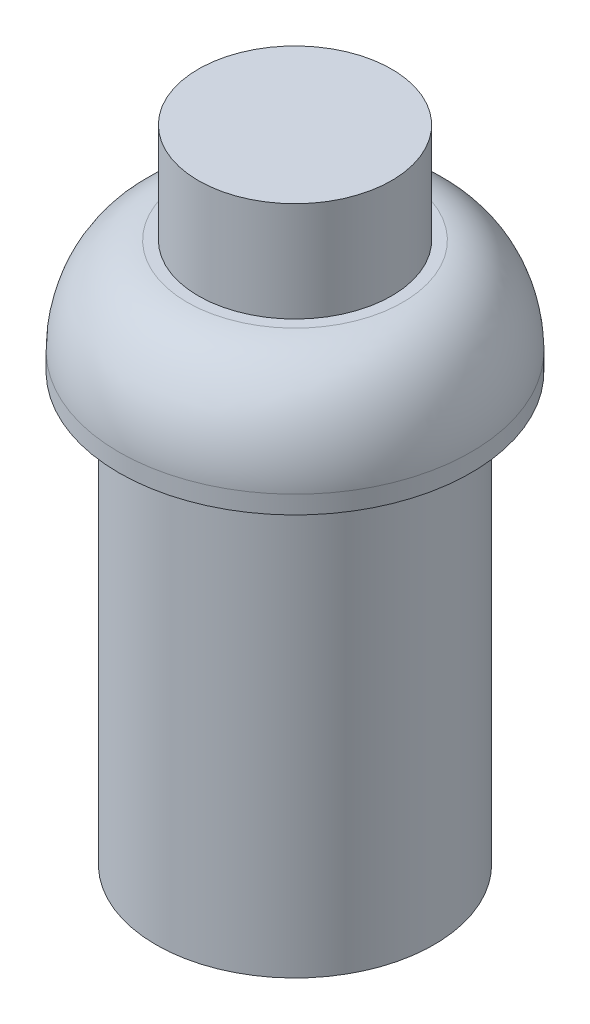
ISO-10303-21;
HEADER;
FILE_DESCRIPTION(('STEP AP214'),'2;1');
FILE_NAME('part.step','',(''),(''),'','','');
FILE_SCHEMA(('AUTOMOTIVE_DESIGN { 1 0 10303 214 1 1 1 1 }'));
ENDSEC;
DATA;
#1=APPLICATION_CONTEXT('core data for automotive mechanical design processes');
#2=APPLICATION_PROTOCOL_DEFINITION('international standard','automotive_design',2000,#1);
#3=PRODUCT_CONTEXT('',#1,'mechanical');
#4=PRODUCT('Part','Part','',(#3));
#5=PRODUCT_RELATED_PRODUCT_CATEGORY('part','',(#4));
#6=PRODUCT_DEFINITION_FORMATION('','',#4);
#7=PRODUCT_DEFINITION_CONTEXT('part definition',#1,'design');
#8=PRODUCT_DEFINITION('design','',#6,#7);
#9=PRODUCT_DEFINITION_SHAPE('','',#8);
#10=(LENGTH_UNIT() NAMED_UNIT(*) SI_UNIT(.MILLI.,.METRE.));
#11=(NAMED_UNIT(*) PLANE_ANGLE_UNIT() SI_UNIT($,.RADIAN.));
#12=(NAMED_UNIT(*) SI_UNIT($,.STERADIAN.) SOLID_ANGLE_UNIT());
#13=UNCERTAINTY_MEASURE_WITH_UNIT(LENGTH_MEASURE(1.E-05),#10,'distance_accuracy_value','');
#14=(GEOMETRIC_REPRESENTATION_CONTEXT(3) GLOBAL_UNCERTAINTY_ASSIGNED_CONTEXT((#13)) GLOBAL_UNIT_ASSIGNED_CONTEXT((#10,
#11,#12)) REPRESENTATION_CONTEXT('',''));
#15=CARTESIAN_POINT('',(0.,0.,0.));
#16=DIRECTION('',(0.,0.,1.));
#17=DIRECTION('',(1.,0.,0.));
#18=AXIS2_PLACEMENT_3D('',#15,#16,#17);
#19=CARTESIAN_POINT('',(0.,3.16,0.));
#20=DIRECTION('',(0.,1.,0.));
#21=DIRECTION('',(0.,0.,1.));
#22=AXIS2_PLACEMENT_3D('',#19,#20,#21);
#23=PLANE('',#22);
#24=CARTESIAN_POINT('',(0.,3.16,0.));
#25=DIRECTION('',(0.,-1.,0.));
#26=DIRECTION('',(0.,0.,-1.));
#27=AXIS2_PLACEMENT_3D('',#24,#25,#26);
#28=CIRCLE('',#27,3.);
#29=CARTESIAN_POINT('',(0.,3.16,-3.));
#30=VERTEX_POINT('',#29);
#31=EDGE_CURVE('E53',#30,#30,#28,.T.);
#32=ORIENTED_EDGE('',*,*,#31,.F.);
#33=EDGE_LOOP('',(#32));
#34=FACE_BOUND('',#33,.T.);
#35=CARTESIAN_POINT('',(0.,3.16,0.));
#36=DIRECTION('',(0.,1.,0.));
#37=DIRECTION('',(0.,0.,1.));
#38=AXIS2_PLACEMENT_3D('',#35,#36,#37);
#39=CIRCLE('',#38,2.69);
#40=CARTESIAN_POINT('',(0.,3.16,2.69));
#41=VERTEX_POINT('',#40);
#42=EDGE_CURVE('E61',#41,#41,#39,.T.);
#43=ORIENTED_EDGE('',*,*,#42,.F.);
#44=EDGE_LOOP('',(#43));
#45=FACE_BOUND('',#44,.T.);
#46=ADVANCED_FACE('F35',(#34,#45),#23,.T.);
#47=CARTESIAN_POINT('',(0.,-11.89,0.));
#48=DIRECTION('',(0.,1.,0.));
#49=DIRECTION('',(0.,0.,1.));
#50=AXIS2_PLACEMENT_3D('',#47,#48,#49);
#51=CYLINDRICAL_SURFACE('',#50,3.87);
#52=CARTESIAN_POINT('',(0.,-11.89,0.));
#53=DIRECTION('',(0.,1.,0.));
#54=DIRECTION('',(0.,0.,1.));
#55=AXIS2_PLACEMENT_3D('',#52,#53,#54);
#56=CIRCLE('',#55,3.87);
#57=CARTESIAN_POINT('',(0.,-11.89,3.87));
#58=VERTEX_POINT('',#57);
#59=EDGE_CURVE('E10',#58,#58,#56,.T.);
#60=ORIENTED_EDGE('',*,*,#59,.T.);
#61=EDGE_LOOP('',(#60));
#62=FACE_BOUND('',#61,.T.);
#63=CARTESIAN_POINT('',(0.,0.,0.));
#64=DIRECTION('',(0.,1.,0.));
#65=DIRECTION('',(0.,0.,1.));
#66=AXIS2_PLACEMENT_3D('',#63,#64,#65);
#67=CIRCLE('',#66,3.87);
#68=CARTESIAN_POINT('',(0.,0.,3.87));
#69=VERTEX_POINT('',#68);
#70=EDGE_CURVE('E39',#69,#69,#67,.T.);
#71=ORIENTED_EDGE('',*,*,#70,.F.);
#72=EDGE_LOOP('',(#71));
#73=FACE_BOUND('',#72,.T.);
#74=ADVANCED_FACE('F37',(#62,#73),#51,.T.);
#75=CARTESIAN_POINT('',(0.,-11.89,0.));
#76=DIRECTION('',(0.,1.,0.));
#77=DIRECTION('',(0.,0.,1.));
#78=AXIS2_PLACEMENT_3D('',#75,#76,#77);
#79=PLANE('',#78);
#80=ORIENTED_EDGE('',*,*,#59,.F.);
#81=EDGE_LOOP('',(#80));
#82=FACE_BOUND('',#81,.T.);
#83=ADVANCED_FACE('F80',(#82),#79,.F.);
#84=CARTESIAN_POINT('',(0.,0.,0.));
#85=DIRECTION('',(0.,-1.,0.));
#86=DIRECTION('',(0.,0.,-1.));
#87=AXIS2_PLACEMENT_3D('',#84,#85,#86);
#88=PLANE('',#87);
#89=ORIENTED_EDGE('',*,*,#70,.T.);
#90=EDGE_LOOP('',(#89));
#91=FACE_BOUND('',#90,.T.);
#92=CARTESIAN_POINT('',(0.,0.,0.));
#93=DIRECTION('',(0.,-1.,0.));
#94=DIRECTION('',(0.,0.,-1.));
#95=AXIS2_PLACEMENT_3D('',#92,#93,#94);
#96=CIRCLE('',#95,4.9);
#97=CARTESIAN_POINT('',(0.,0.,-4.9));
#98=VERTEX_POINT('',#97);
#99=EDGE_CURVE('E46',#98,#98,#96,.T.);
#100=ORIENTED_EDGE('',*,*,#99,.T.);
#101=EDGE_LOOP('',(#100));
#102=FACE_BOUND('',#101,.T.);
#103=ADVANCED_FACE('F77',(#91,#102),#88,.T.);
#104=CARTESIAN_POINT('',(0.,0.,0.));
#105=DIRECTION('',(0.,-1.,0.));
#106=DIRECTION('',(0.,0.,-1.));
#107=AXIS2_PLACEMENT_3D('',#104,#105,#106);
#108=CYLINDRICAL_SURFACE('',#107,4.9);
#109=CARTESIAN_POINT('',(0.,0.5,0.));
#110=DIRECTION('',(0.,-1.,0.));
#111=DIRECTION('',(0.,0.,-1.));
#112=AXIS2_PLACEMENT_3D('',#109,#110,#111);
#113=CIRCLE('',#112,4.9);
#114=CARTESIAN_POINT('',(0.,0.5,-4.9));
#115=VERTEX_POINT('',#114);
#116=EDGE_CURVE('E50',#115,#115,#113,.T.);
#117=ORIENTED_EDGE('',*,*,#116,.T.);
#118=EDGE_LOOP('',(#117));
#119=FACE_BOUND('',#118,.T.);
#120=ORIENTED_EDGE('',*,*,#99,.F.);
#121=EDGE_LOOP('',(#120));
#122=FACE_BOUND('',#121,.T.);
#123=ADVANCED_FACE('F72',(#119,#122),#108,.T.);
#124=CARTESIAN_POINT('',(4.9,0.5,0.));
#125=CARTESIAN_POINT('',(4.90089059804977,1.63201665466107,0.));
#126=CARTESIAN_POINT('',(4.28363947511637,3.02402476463722,0.));
#127=CARTESIAN_POINT('',(3.,3.16,0.));
#128=B_SPLINE_CURVE_WITH_KNOTS('',3,(#124,#125,#126,#127),.UNSPECIFIED.,.F.,.F.,(4,4),(0.,1.),.UNSPECIFIED.);
#129=CARTESIAN_POINT('',(0.,0.,0.));
#130=DIRECTION('',(0.,-1.,0.));
#131=AXIS1_PLACEMENT('',#129,#130);
#132=SURFACE_OF_REVOLUTION('',#128,#131);
#133=ORIENTED_EDGE('',*,*,#31,.T.);
#134=EDGE_LOOP('',(#133));
#135=FACE_BOUND('',#134,.T.);
#136=ORIENTED_EDGE('',*,*,#116,.F.);
#137=EDGE_LOOP('',(#136));
#138=FACE_BOUND('',#137,.T.);
#139=ADVANCED_FACE('F67',(#135,#138),#132,.F.);
#140=CARTESIAN_POINT('',(0.,5.94,0.));
#141=DIRECTION('',(0.,-1.,0.));
#142=DIRECTION('',(0.,0.,-1.));
#143=AXIS2_PLACEMENT_3D('',#140,#141,#142);
#144=CYLINDRICAL_SURFACE('',#143,2.69);
#145=CARTESIAN_POINT('',(0.,5.94,0.));
#146=DIRECTION('',(0.,1.,0.));
#147=DIRECTION('',(0.,0.,1.));
#148=AXIS2_PLACEMENT_3D('',#145,#146,#147);
#149=CIRCLE('',#148,2.69);
#150=CARTESIAN_POINT('',(0.,5.94,2.69));
#151=VERTEX_POINT('',#150);
#152=EDGE_CURVE('E56',#151,#151,#149,.T.);
#153=ORIENTED_EDGE('',*,*,#152,.F.);
#154=EDGE_LOOP('',(#153));
#155=FACE_BOUND('',#154,.T.);
#156=ORIENTED_EDGE('',*,*,#42,.T.);
#157=EDGE_LOOP('',(#156));
#158=FACE_BOUND('',#157,.T.);
#159=ADVANCED_FACE('F71',(#155,#158),#144,.T.);
#160=CARTESIAN_POINT('',(0.,5.94,0.));
#161=DIRECTION('',(0.,1.,0.));
#162=DIRECTION('',(0.,0.,1.));
#163=AXIS2_PLACEMENT_3D('',#160,#161,#162);
#164=PLANE('',#163);
#165=ORIENTED_EDGE('',*,*,#152,.T.);
#166=EDGE_LOOP('',(#165));
#167=FACE_BOUND('',#166,.T.);
#168=ADVANCED_FACE('F99',(#167),#164,.T.);
#169=CLOSED_SHELL('',(#46,#74,#83,#103,#123,#139,#159,#168));
#170=MANIFOLD_SOLID_BREP('B2',#169);
#171=ADVANCED_BREP_SHAPE_REPRESENTATION('',(#18,#170),#14);
#172=SHAPE_DEFINITION_REPRESENTATION(#9,#171);
ENDSEC;
END-ISO-10303-21;
